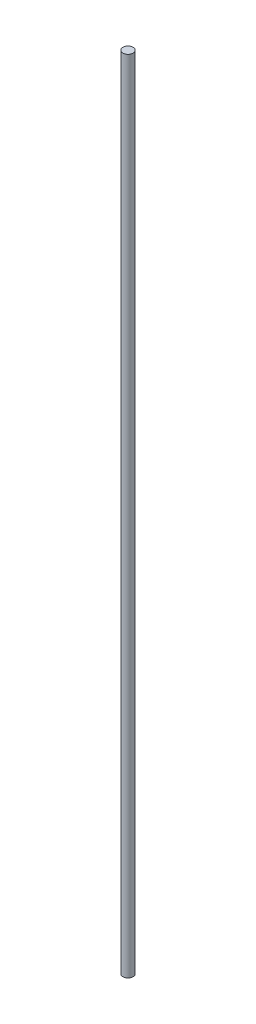
ISO-10303-21;
HEADER;
FILE_DESCRIPTION(('STEP AP214'),'2;1');
FILE_NAME('part.step','',(''),(''),'','','');
FILE_SCHEMA(('AUTOMOTIVE_DESIGN { 1 0 10303 214 1 1 1 1 }'));
ENDSEC;
DATA;
#1=APPLICATION_CONTEXT('core data for automotive mechanical design processes');
#2=APPLICATION_PROTOCOL_DEFINITION('international standard','automotive_design',2000,#1);
#3=PRODUCT_CONTEXT('',#1,'mechanical');
#4=PRODUCT('Part','Part','',(#3));
#5=PRODUCT_RELATED_PRODUCT_CATEGORY('part','',(#4));
#6=PRODUCT_DEFINITION_FORMATION('','',#4);
#7=PRODUCT_DEFINITION_CONTEXT('part definition',#1,'design');
#8=PRODUCT_DEFINITION('design','',#6,#7);
#9=PRODUCT_DEFINITION_SHAPE('','',#8);
#10=(LENGTH_UNIT() NAMED_UNIT(*) SI_UNIT(.MILLI.,.METRE.));
#11=(NAMED_UNIT(*) PLANE_ANGLE_UNIT() SI_UNIT($,.RADIAN.));
#12=(NAMED_UNIT(*) SI_UNIT($,.STERADIAN.) SOLID_ANGLE_UNIT());
#13=UNCERTAINTY_MEASURE_WITH_UNIT(LENGTH_MEASURE(1.E-05),#10,'distance_accuracy_value','');
#14=(GEOMETRIC_REPRESENTATION_CONTEXT(3) GLOBAL_UNCERTAINTY_ASSIGNED_CONTEXT((#13)) GLOBAL_UNIT_ASSIGNED_CONTEXT((#10,
#11,#12)) REPRESENTATION_CONTEXT('',''));
#15=CARTESIAN_POINT('',(0.,0.,0.));
#16=DIRECTION('',(0.,0.,1.));
#17=DIRECTION('',(1.,0.,0.));
#18=AXIS2_PLACEMENT_3D('',#15,#16,#17);
#19=CARTESIAN_POINT('',(0.,3131.82,0.));
#20=DIRECTION('',(0.,-1.,0.));
#21=DIRECTION('',(0.,0.,-1.));
#22=AXIS2_PLACEMENT_3D('',#19,#20,#21);
#23=CYLINDRICAL_SURFACE('',#22,20.);
#24=CARTESIAN_POINT('',(0.,3131.82,0.));
#25=DIRECTION('',(0.,1.,0.));
#26=DIRECTION('',(0.,0.,1.));
#27=AXIS2_PLACEMENT_3D('',#24,#25,#26);
#28=CIRCLE('',#27,20.);
#29=CARTESIAN_POINT('',(0.,3131.82,20.));
#30=VERTEX_POINT('',#29);
#31=EDGE_CURVE('E10',#30,#30,#28,.T.);
#32=ORIENTED_EDGE('',*,*,#31,.F.);
#33=EDGE_LOOP('',(#32));
#34=FACE_BOUND('',#33,.T.);
#35=CARTESIAN_POINT('',(0.,0.,0.));
#36=DIRECTION('',(0.,1.,0.));
#37=DIRECTION('',(0.,0.,1.));
#38=AXIS2_PLACEMENT_3D('',#35,#36,#37);
#39=CIRCLE('',#38,20.);
#40=CARTESIAN_POINT('',(0.,0.,20.));
#41=VERTEX_POINT('',#40);
#42=EDGE_CURVE('E36',#41,#41,#39,.T.);
#43=ORIENTED_EDGE('',*,*,#42,.T.);
#44=EDGE_LOOP('',(#43));
#45=FACE_BOUND('',#44,.T.);
#46=ADVANCED_FACE('F33',(#34,#45),#23,.T.);
#47=CARTESIAN_POINT('',(0.,3131.82,0.));
#48=DIRECTION('',(0.,1.,0.));
#49=DIRECTION('',(0.,0.,1.));
#50=AXIS2_PLACEMENT_3D('',#47,#48,#49);
#51=PLANE('',#50);
#52=ORIENTED_EDGE('',*,*,#31,.T.);
#53=EDGE_LOOP('',(#52));
#54=FACE_BOUND('',#53,.T.);
#55=ADVANCED_FACE('F48',(#54),#51,.T.);
#56=CARTESIAN_POINT('',(0.,0.,0.));
#57=DIRECTION('',(0.,1.,0.));
#58=DIRECTION('',(0.,0.,1.));
#59=AXIS2_PLACEMENT_3D('',#56,#57,#58);
#60=PLANE('',#59);
#61=ORIENTED_EDGE('',*,*,#42,.F.);
#62=EDGE_LOOP('',(#61));
#63=FACE_BOUND('',#62,.T.);
#64=ADVANCED_FACE('F46',(#63),#60,.F.);
#65=CLOSED_SHELL('',(#46,#55,#64));
#66=MANIFOLD_SOLID_BREP('B2',#65);
#67=ADVANCED_BREP_SHAPE_REPRESENTATION('',(#18,#66),#14);
#68=SHAPE_DEFINITION_REPRESENTATION(#9,#67);
ENDSEC;
END-ISO-10303-21;
